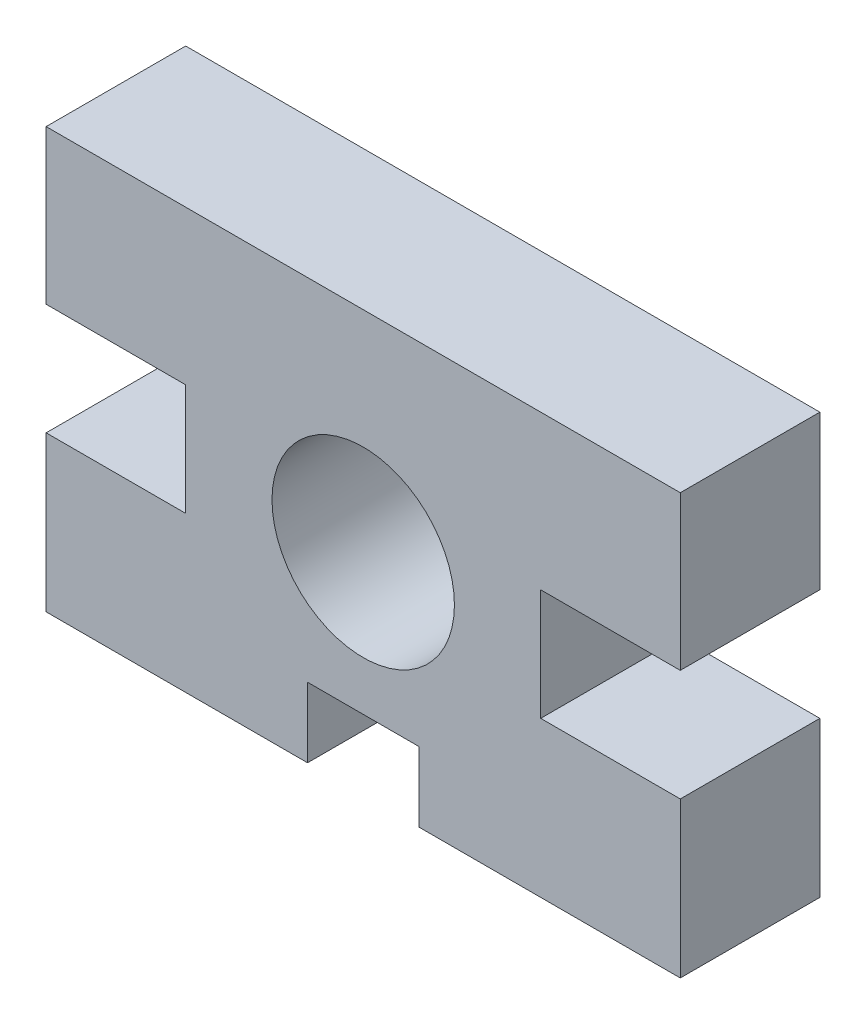
ISO-10303-21;
HEADER;
FILE_DESCRIPTION(('STEP AP214'),'2;1');
FILE_NAME('part.step','',(''),(''),'','','');
FILE_SCHEMA(('AUTOMOTIVE_DESIGN { 1 0 10303 214 1 1 1 1 }'));
ENDSEC;
DATA;
#1=APPLICATION_CONTEXT('core data for automotive mechanical design processes');
#2=APPLICATION_PROTOCOL_DEFINITION('international standard','automotive_design',2000,#1);
#3=PRODUCT_CONTEXT('',#1,'mechanical');
#4=PRODUCT('Part','Part','',(#3));
#5=PRODUCT_RELATED_PRODUCT_CATEGORY('part','',(#4));
#6=PRODUCT_DEFINITION_FORMATION('','',#4);
#7=PRODUCT_DEFINITION_CONTEXT('part definition',#1,'design');
#8=PRODUCT_DEFINITION('design','',#6,#7);
#9=PRODUCT_DEFINITION_SHAPE('','',#8);
#10=(LENGTH_UNIT() NAMED_UNIT(*) SI_UNIT(.MILLI.,.METRE.));
#11=(NAMED_UNIT(*) PLANE_ANGLE_UNIT() SI_UNIT($,.RADIAN.));
#12=(NAMED_UNIT(*) SI_UNIT($,.STERADIAN.) SOLID_ANGLE_UNIT());
#13=UNCERTAINTY_MEASURE_WITH_UNIT(LENGTH_MEASURE(1.E-05),#10,'distance_accuracy_value','');
#14=(GEOMETRIC_REPRESENTATION_CONTEXT(3) GLOBAL_UNCERTAINTY_ASSIGNED_CONTEXT((#13)) GLOBAL_UNIT_ASSIGNED_CONTEXT((#10,
#11,#12)) REPRESENTATION_CONTEXT('',''));
#15=CARTESIAN_POINT('',(0.,0.,0.));
#16=DIRECTION('',(0.,0.,1.));
#17=DIRECTION('',(1.,0.,0.));
#18=AXIS2_PLACEMENT_3D('',#15,#16,#17);
#19=CARTESIAN_POINT('',(0.,0.,6.35));
#20=DIRECTION('',(0.,0.,1.));
#21=DIRECTION('',(1.,0.,0.));
#22=AXIS2_PLACEMENT_3D('',#19,#20,#21);
#23=PLANE('',#22);
#24=DIRECTION('',(1.,0.,0.));
#25=VECTOR('',#24,1.);
#26=CARTESIAN_POINT('',(2.53250000000001,-9.56,6.35));
#27=LINE('',#26,#25);
#28=CARTESIAN_POINT('',(2.53250000000001,-9.56,6.35));
#29=VERTEX_POINT('',#28);
#30=CARTESIAN_POINT('',(14.425,-9.56,6.35));
#31=VERTEX_POINT('',#30);
#32=EDGE_CURVE('E240',#29,#31,#27,.T.);
#33=ORIENTED_EDGE('',*,*,#32,.T.);
#34=DIRECTION('',(0.,1.,0.));
#35=VECTOR('',#34,1.);
#36=CARTESIAN_POINT('',(14.425,-9.56,6.35));
#37=LINE('',#36,#35);
#38=CARTESIAN_POINT('',(14.425,-2.50514793188962,6.35));
#39=VERTEX_POINT('',#38);
#40=EDGE_CURVE('E127',#31,#39,#37,.T.);
#41=ORIENTED_EDGE('',*,*,#40,.T.);
#42=DIRECTION('',(-1.,0.,0.));
#43=VECTOR('',#42,1.);
#44=CARTESIAN_POINT('',(14.425,-2.50514793188962,6.35));
#45=LINE('',#44,#43);
#46=CARTESIAN_POINT('',(8.075,-2.50514793188962,6.35));
#47=VERTEX_POINT('',#46);
#48=EDGE_CURVE('E293',#39,#47,#45,.T.);
#49=ORIENTED_EDGE('',*,*,#48,.T.);
#50=DIRECTION('',(0.,1.,0.));
#51=VECTOR('',#50,1.);
#52=CARTESIAN_POINT('',(8.075,-2.50514793188962,6.35));
#53=LINE('',#52,#51);
#54=CARTESIAN_POINT('',(8.075,2.56000000000001,6.35));
#55=VERTEX_POINT('',#54);
#56=EDGE_CURVE('E313',#47,#55,#53,.T.);
#57=ORIENTED_EDGE('',*,*,#56,.T.);
#58=DIRECTION('',(1.,0.,0.));
#59=VECTOR('',#58,1.);
#60=CARTESIAN_POINT('',(8.075,2.56000000000001,6.35));
#61=LINE('',#60,#59);
#62=CARTESIAN_POINT('',(14.425,2.56,6.35));
#63=VERTEX_POINT('',#62);
#64=EDGE_CURVE('E309',#55,#63,#61,.T.);
#65=ORIENTED_EDGE('',*,*,#64,.T.);
#66=DIRECTION('',(0.,1.,0.));
#67=VECTOR('',#66,1.);
#68=CARTESIAN_POINT('',(14.425,9.56000000000001,6.35));
#69=LINE('',#68,#67);
#70=CARTESIAN_POINT('',(14.425,9.56000000000001,6.35));
#71=VERTEX_POINT('',#70);
#72=EDGE_CURVE('E312',#63,#71,#69,.T.);
#73=ORIENTED_EDGE('',*,*,#72,.T.);
#74=DIRECTION('',(-1.,0.,0.));
#75=VECTOR('',#74,1.);
#76=CARTESIAN_POINT('',(-14.425,9.56,6.35));
#77=LINE('',#76,#75);
#78=CARTESIAN_POINT('',(-14.425,9.56,6.35));
#79=VERTEX_POINT('',#78);
#80=EDGE_CURVE('E317',#71,#79,#77,.T.);
#81=ORIENTED_EDGE('',*,*,#80,.T.);
#82=DIRECTION('',(0.,-1.,0.));
#83=VECTOR('',#82,1.);
#84=CARTESIAN_POINT('',(-14.425,9.56,6.35));
#85=LINE('',#84,#83);
#86=CARTESIAN_POINT('',(-14.425,2.56,6.35));
#87=VERTEX_POINT('',#86);
#88=EDGE_CURVE('E324',#79,#87,#85,.T.);
#89=ORIENTED_EDGE('',*,*,#88,.T.);
#90=DIRECTION('',(1.,0.,0.));
#91=VECTOR('',#90,1.);
#92=CARTESIAN_POINT('',(-8.075,2.56000000000001,6.35));
#93=LINE('',#92,#91);
#94=CARTESIAN_POINT('',(-8.075,2.56000000000001,6.35));
#95=VERTEX_POINT('',#94);
#96=EDGE_CURVE('E327',#87,#95,#93,.T.);
#97=ORIENTED_EDGE('',*,*,#96,.T.);
#98=DIRECTION('',(0.,-1.,0.));
#99=VECTOR('',#98,1.);
#100=CARTESIAN_POINT('',(-8.075,-2.50514793188962,6.35));
#101=LINE('',#100,#99);
#102=CARTESIAN_POINT('',(-8.075,-2.50514793188962,6.35));
#103=VERTEX_POINT('',#102);
#104=EDGE_CURVE('E330',#95,#103,#101,.T.);
#105=ORIENTED_EDGE('',*,*,#104,.T.);
#106=DIRECTION('',(-1.,0.,0.));
#107=VECTOR('',#106,1.);
#108=CARTESIAN_POINT('',(-14.425,-2.50514793188962,6.35));
#109=LINE('',#108,#107);
#110=CARTESIAN_POINT('',(-14.425,-2.50514793188962,6.35));
#111=VERTEX_POINT('',#110);
#112=EDGE_CURVE('E333',#103,#111,#109,.T.);
#113=ORIENTED_EDGE('',*,*,#112,.T.);
#114=DIRECTION('',(0.,-1.,0.));
#115=VECTOR('',#114,1.);
#116=CARTESIAN_POINT('',(-14.425,-9.56,6.35));
#117=LINE('',#116,#115);
#118=CARTESIAN_POINT('',(-14.425,-9.56,6.35));
#119=VERTEX_POINT('',#118);
#120=EDGE_CURVE('E336',#111,#119,#117,.T.);
#121=ORIENTED_EDGE('',*,*,#120,.T.);
#122=DIRECTION('',(1.,0.,0.));
#123=VECTOR('',#122,1.);
#124=CARTESIAN_POINT('',(-14.425,-9.56,6.35));
#125=LINE('',#124,#123);
#126=CARTESIAN_POINT('',(-2.53249999999999,-9.56,6.35));
#127=VERTEX_POINT('',#126);
#128=EDGE_CURVE('E170',#119,#127,#125,.T.);
#129=ORIENTED_EDGE('',*,*,#128,.T.);
#130=DIRECTION('',(0.,1.,0.));
#131=VECTOR('',#130,1.);
#132=CARTESIAN_POINT('',(-2.53249999999999,-9.56,6.35));
#133=LINE('',#132,#131);
#134=CARTESIAN_POINT('',(-2.53249999999999,-6.38499999999999,6.35));
#135=VERTEX_POINT('',#134);
#136=EDGE_CURVE('E164',#127,#135,#133,.T.);
#137=ORIENTED_EDGE('',*,*,#136,.T.);
#138=DIRECTION('',(1.,0.,0.));
#139=VECTOR('',#138,1.);
#140=CARTESIAN_POINT('',(0.,-6.38499999999999,6.35));
#141=LINE('',#140,#139);
#142=CARTESIAN_POINT('',(2.53250000000001,-6.38499999999999,6.35));
#143=VERTEX_POINT('',#142);
#144=EDGE_CURVE('E168',#135,#143,#141,.T.);
#145=ORIENTED_EDGE('',*,*,#144,.T.);
#146=DIRECTION('',(0.,-1.,0.));
#147=VECTOR('',#146,1.);
#148=CARTESIAN_POINT('',(2.53250000000001,-6.38499999999999,6.35));
#149=LINE('',#148,#147);
#150=EDGE_CURVE('E61',#143,#29,#149,.T.);
#151=ORIENTED_EDGE('',*,*,#150,.T.);
#152=EDGE_LOOP('',(#33,#41,#49,#57,#65,#73,#81,#89,#97,#105,#113,#121,#129,#137,#145,#151));
#153=FACE_BOUND('',#152,.T.);
#154=CARTESIAN_POINT('',(0.,0.,6.35));
#155=DIRECTION('',(0.,0.,1.));
#156=DIRECTION('',(1.,0.,0.));
#157=AXIS2_PLACEMENT_3D('',#154,#155,#156);
#158=CIRCLE('',#157,4.15);
#159=CARTESIAN_POINT('',(4.15,0.,6.35));
#160=VERTEX_POINT('',#159);
#161=EDGE_CURVE('E198',#160,#160,#158,.T.);
#162=ORIENTED_EDGE('',*,*,#161,.F.);
#163=EDGE_LOOP('',(#162));
#164=FACE_BOUND('',#163,.T.);
#165=ADVANCED_FACE('F43',(#153,#164),#23,.T.);
#166=CARTESIAN_POINT('',(0.,0.,0.));
#167=DIRECTION('',(0.,0.,1.));
#168=DIRECTION('',(1.,0.,0.));
#169=AXIS2_PLACEMENT_3D('',#166,#167,#168);
#170=PLANE('',#169);
#171=DIRECTION('',(1.,0.,0.));
#172=VECTOR('',#171,1.);
#173=CARTESIAN_POINT('',(2.53250000000001,-9.56,0.));
#174=LINE('',#173,#172);
#175=CARTESIAN_POINT('',(2.53250000000001,-9.56,0.));
#176=VERTEX_POINT('',#175);
#177=CARTESIAN_POINT('',(14.425,-9.56,0.));
#178=VERTEX_POINT('',#177);
#179=EDGE_CURVE('E193',#176,#178,#174,.T.);
#180=ORIENTED_EDGE('',*,*,#179,.F.);
#181=DIRECTION('',(0.,-1.,0.));
#182=VECTOR('',#181,1.);
#183=CARTESIAN_POINT('',(2.53250000000001,-6.38499999999999,0.));
#184=LINE('',#183,#182);
#185=CARTESIAN_POINT('',(2.53250000000001,-6.38499999999999,0.));
#186=VERTEX_POINT('',#185);
#187=EDGE_CURVE('E119',#186,#176,#184,.T.);
#188=ORIENTED_EDGE('',*,*,#187,.F.);
#189=DIRECTION('',(1.,0.,0.));
#190=VECTOR('',#189,1.);
#191=CARTESIAN_POINT('',(0.,-6.38499999999999,0.));
#192=LINE('',#191,#190);
#193=CARTESIAN_POINT('',(-2.53249999999999,-6.38499999999999,0.));
#194=VERTEX_POINT('',#193);
#195=EDGE_CURVE('E113',#194,#186,#192,.T.);
#196=ORIENTED_EDGE('',*,*,#195,.F.);
#197=DIRECTION('',(0.,1.,0.));
#198=VECTOR('',#197,1.);
#199=CARTESIAN_POINT('',(-2.53249999999999,-9.56,0.));
#200=LINE('',#199,#198);
#201=CARTESIAN_POINT('',(-2.53249999999999,-9.56,0.));
#202=VERTEX_POINT('',#201);
#203=EDGE_CURVE('E180',#202,#194,#200,.T.);
#204=ORIENTED_EDGE('',*,*,#203,.F.);
#205=DIRECTION('',(1.,0.,0.));
#206=VECTOR('',#205,1.);
#207=CARTESIAN_POINT('',(-14.425,-9.56,0.));
#208=LINE('',#207,#206);
#209=CARTESIAN_POINT('',(-14.425,-9.56,0.));
#210=VERTEX_POINT('',#209);
#211=EDGE_CURVE('E231',#210,#202,#208,.T.);
#212=ORIENTED_EDGE('',*,*,#211,.F.);
#213=DIRECTION('',(0.,-1.,0.));
#214=VECTOR('',#213,1.);
#215=CARTESIAN_POINT('',(-14.425,-9.56,0.));
#216=LINE('',#215,#214);
#217=CARTESIAN_POINT('',(-14.425,-2.50514793188962,0.));
#218=VERTEX_POINT('',#217);
#219=EDGE_CURVE('E228',#218,#210,#216,.T.);
#220=ORIENTED_EDGE('',*,*,#219,.F.);
#221=DIRECTION('',(-1.,0.,0.));
#222=VECTOR('',#221,1.);
#223=CARTESIAN_POINT('',(-14.425,-2.50514793188962,0.));
#224=LINE('',#223,#222);
#225=CARTESIAN_POINT('',(-8.075,-2.50514793188962,0.));
#226=VERTEX_POINT('',#225);
#227=EDGE_CURVE('E225',#226,#218,#224,.T.);
#228=ORIENTED_EDGE('',*,*,#227,.F.);
#229=DIRECTION('',(0.,-1.,0.));
#230=VECTOR('',#229,1.);
#231=CARTESIAN_POINT('',(-8.075,-2.50514793188962,0.));
#232=LINE('',#231,#230);
#233=CARTESIAN_POINT('',(-8.075,2.56000000000001,0.));
#234=VERTEX_POINT('',#233);
#235=EDGE_CURVE('E222',#234,#226,#232,.T.);
#236=ORIENTED_EDGE('',*,*,#235,.F.);
#237=DIRECTION('',(1.,0.,0.));
#238=VECTOR('',#237,1.);
#239=CARTESIAN_POINT('',(-8.075,2.56000000000001,0.));
#240=LINE('',#239,#238);
#241=CARTESIAN_POINT('',(-14.425,2.56,0.));
#242=VERTEX_POINT('',#241);
#243=EDGE_CURVE('E219',#242,#234,#240,.T.);
#244=ORIENTED_EDGE('',*,*,#243,.F.);
#245=DIRECTION('',(0.,-1.,0.));
#246=VECTOR('',#245,1.);
#247=CARTESIAN_POINT('',(-14.425,9.56,0.));
#248=LINE('',#247,#246);
#249=CARTESIAN_POINT('',(-14.425,9.56,0.));
#250=VERTEX_POINT('',#249);
#251=EDGE_CURVE('E216',#250,#242,#248,.T.);
#252=ORIENTED_EDGE('',*,*,#251,.F.);
#253=DIRECTION('',(-1.,0.,0.));
#254=VECTOR('',#253,1.);
#255=CARTESIAN_POINT('',(-14.425,9.56,0.));
#256=LINE('',#255,#254);
#257=CARTESIAN_POINT('',(14.425,9.56000000000001,0.));
#258=VERTEX_POINT('',#257);
#259=EDGE_CURVE('E213',#258,#250,#256,.T.);
#260=ORIENTED_EDGE('',*,*,#259,.F.);
#261=DIRECTION('',(0.,1.,0.));
#262=VECTOR('',#261,1.);
#263=CARTESIAN_POINT('',(14.425,9.56000000000001,0.));
#264=LINE('',#263,#262);
#265=CARTESIAN_POINT('',(14.425,2.56,0.));
#266=VERTEX_POINT('',#265);
#267=EDGE_CURVE('E210',#266,#258,#264,.T.);
#268=ORIENTED_EDGE('',*,*,#267,.F.);
#269=DIRECTION('',(1.,0.,0.));
#270=VECTOR('',#269,1.);
#271=CARTESIAN_POINT('',(8.075,2.56000000000001,0.));
#272=LINE('',#271,#270);
#273=CARTESIAN_POINT('',(8.075,2.56000000000001,0.));
#274=VERTEX_POINT('',#273);
#275=EDGE_CURVE('E207',#274,#266,#272,.T.);
#276=ORIENTED_EDGE('',*,*,#275,.F.);
#277=DIRECTION('',(0.,1.,0.));
#278=VECTOR('',#277,1.);
#279=CARTESIAN_POINT('',(8.075,-2.50514793188962,0.));
#280=LINE('',#279,#278);
#281=CARTESIAN_POINT('',(8.075,-2.50514793188962,0.));
#282=VERTEX_POINT('',#281);
#283=EDGE_CURVE('E204',#282,#274,#280,.T.);
#284=ORIENTED_EDGE('',*,*,#283,.F.);
#285=DIRECTION('',(-1.,0.,0.));
#286=VECTOR('',#285,1.);
#287=CARTESIAN_POINT('',(14.425,-2.50514793188962,0.));
#288=LINE('',#287,#286);
#289=CARTESIAN_POINT('',(14.425,-2.50514793188962,0.));
#290=VERTEX_POINT('',#289);
#291=EDGE_CURVE('E201',#290,#282,#288,.T.);
#292=ORIENTED_EDGE('',*,*,#291,.F.);
#293=DIRECTION('',(0.,1.,0.));
#294=VECTOR('',#293,1.);
#295=CARTESIAN_POINT('',(14.425,-9.56,0.));
#296=LINE('',#295,#294);
#297=EDGE_CURVE('E197',#178,#290,#296,.T.);
#298=ORIENTED_EDGE('',*,*,#297,.F.);
#299=EDGE_LOOP('',(#180,#188,#196,#204,#212,#220,#228,#236,#244,#252,#260,#268,#276,#284,#292,#298));
#300=FACE_BOUND('',#299,.T.);
#301=CARTESIAN_POINT('',(0.,0.,0.));
#302=DIRECTION('',(0.,0.,1.));
#303=DIRECTION('',(1.,0.,0.));
#304=AXIS2_PLACEMENT_3D('',#301,#302,#303);
#305=CIRCLE('',#304,4.15);
#306=CARTESIAN_POINT('',(4.15,0.,0.));
#307=VERTEX_POINT('',#306);
#308=EDGE_CURVE('E578',#307,#307,#305,.T.);
#309=ORIENTED_EDGE('',*,*,#308,.T.);
#310=EDGE_LOOP('',(#309));
#311=FACE_BOUND('',#310,.T.);
#312=ADVANCED_FACE('F297',(#300,#311),#170,.F.);
#313=CARTESIAN_POINT('',(2.53250000000001,-9.56,6.35));
#314=DIRECTION('',(0.,1.,0.));
#315=DIRECTION('',(0.,0.,1.));
#316=AXIS2_PLACEMENT_3D('',#313,#314,#315);
#317=PLANE('',#316);
#318=ORIENTED_EDGE('',*,*,#179,.T.);
#319=DIRECTION('',(0.,0.,-1.));
#320=VECTOR('',#319,1.);
#321=CARTESIAN_POINT('',(14.425,-9.56,6.35));
#322=LINE('',#321,#320);
#323=EDGE_CURVE('E11',#31,#178,#322,.T.);
#324=ORIENTED_EDGE('',*,*,#323,.F.);
#325=ORIENTED_EDGE('',*,*,#32,.F.);
#326=DIRECTION('',(0.,0.,-1.));
#327=VECTOR('',#326,1.);
#328=CARTESIAN_POINT('',(2.53250000000001,-9.56,6.35));
#329=LINE('',#328,#327);
#330=EDGE_CURVE('E189',#29,#176,#329,.T.);
#331=ORIENTED_EDGE('',*,*,#330,.T.);
#332=EDGE_LOOP('',(#318,#324,#325,#331));
#333=FACE_BOUND('',#332,.T.);
#334=ADVANCED_FACE('F45',(#333),#317,.F.);
#335=CARTESIAN_POINT('',(14.425,-9.56,6.35));
#336=DIRECTION('',(-1.,0.,0.));
#337=DIRECTION('',(0.,-1.,0.));
#338=AXIS2_PLACEMENT_3D('',#335,#336,#337);
#339=PLANE('',#338);
#340=ORIENTED_EDGE('',*,*,#297,.T.);
#341=DIRECTION('',(0.,0.,-1.));
#342=VECTOR('',#341,1.);
#343=CARTESIAN_POINT('',(14.425,-2.50514793188962,6.35));
#344=LINE('',#343,#342);
#345=EDGE_CURVE('E53',#39,#290,#344,.T.);
#346=ORIENTED_EDGE('',*,*,#345,.F.);
#347=ORIENTED_EDGE('',*,*,#40,.F.);
#348=ORIENTED_EDGE('',*,*,#323,.T.);
#349=EDGE_LOOP('',(#340,#346,#347,#348));
#350=FACE_BOUND('',#349,.T.);
#351=ADVANCED_FACE('F372',(#350),#339,.F.);
#352=CARTESIAN_POINT('',(14.425,-2.50514793188962,6.35));
#353=DIRECTION('',(0.,-1.,0.));
#354=DIRECTION('',(1.,0.,0.));
#355=AXIS2_PLACEMENT_3D('',#352,#353,#354);
#356=PLANE('',#355);
#357=ORIENTED_EDGE('',*,*,#291,.T.);
#358=DIRECTION('',(0.,0.,-1.));
#359=VECTOR('',#358,1.);
#360=CARTESIAN_POINT('',(8.075,-2.50514793188962,6.35));
#361=LINE('',#360,#359);
#362=EDGE_CURVE('E283',#47,#282,#361,.T.);
#363=ORIENTED_EDGE('',*,*,#362,.F.);
#364=ORIENTED_EDGE('',*,*,#48,.F.);
#365=ORIENTED_EDGE('',*,*,#345,.T.);
#366=EDGE_LOOP('',(#357,#363,#364,#365));
#367=FACE_BOUND('',#366,.T.);
#368=ADVANCED_FACE('F291',(#367),#356,.F.);
#369=CARTESIAN_POINT('',(8.075,-2.50514793188962,6.35));
#370=DIRECTION('',(-1.,0.,0.));
#371=DIRECTION('',(0.,0.,1.));
#372=AXIS2_PLACEMENT_3D('',#369,#370,#371);
#373=PLANE('',#372);
#374=ORIENTED_EDGE('',*,*,#283,.T.);
#375=DIRECTION('',(0.,0.,-1.));
#376=VECTOR('',#375,1.);
#377=CARTESIAN_POINT('',(8.075,2.56000000000001,6.35));
#378=LINE('',#377,#376);
#379=EDGE_CURVE('E279',#55,#274,#378,.T.);
#380=ORIENTED_EDGE('',*,*,#379,.F.);
#381=ORIENTED_EDGE('',*,*,#56,.F.);
#382=ORIENTED_EDGE('',*,*,#362,.T.);
#383=EDGE_LOOP('',(#374,#380,#381,#382));
#384=FACE_BOUND('',#383,.T.);
#385=ADVANCED_FACE('F303',(#384),#373,.F.);
#386=CARTESIAN_POINT('',(8.075,2.56000000000001,6.35));
#387=DIRECTION('',(0.,1.,0.));
#388=DIRECTION('',(-1.,0.,0.));
#389=AXIS2_PLACEMENT_3D('',#386,#387,#388);
#390=PLANE('',#389);
#391=ORIENTED_EDGE('',*,*,#275,.T.);
#392=DIRECTION('',(0.,0.,-1.));
#393=VECTOR('',#392,1.);
#394=CARTESIAN_POINT('',(14.425,2.56,6.35));
#395=LINE('',#394,#393);
#396=EDGE_CURVE('E275',#63,#266,#395,.T.);
#397=ORIENTED_EDGE('',*,*,#396,.F.);
#398=ORIENTED_EDGE('',*,*,#64,.F.);
#399=ORIENTED_EDGE('',*,*,#379,.T.);
#400=EDGE_LOOP('',(#391,#397,#398,#399));
#401=FACE_BOUND('',#400,.T.);
#402=ADVANCED_FACE('F307',(#401),#390,.F.);
#403=CARTESIAN_POINT('',(14.425,9.56000000000001,6.35));
#404=DIRECTION('',(-1.,0.,0.));
#405=DIRECTION('',(0.,-1.,0.));
#406=AXIS2_PLACEMENT_3D('',#403,#404,#405);
#407=PLANE('',#406);
#408=ORIENTED_EDGE('',*,*,#267,.T.);
#409=DIRECTION('',(0.,0.,-1.));
#410=VECTOR('',#409,1.);
#411=CARTESIAN_POINT('',(14.425,9.56000000000001,6.35));
#412=LINE('',#411,#410);
#413=EDGE_CURVE('E271',#71,#258,#412,.T.);
#414=ORIENTED_EDGE('',*,*,#413,.F.);
#415=ORIENTED_EDGE('',*,*,#72,.F.);
#416=ORIENTED_EDGE('',*,*,#396,.T.);
#417=EDGE_LOOP('',(#408,#414,#415,#416));
#418=FACE_BOUND('',#417,.T.);
#419=ADVANCED_FACE('F385',(#418),#407,.F.);
#420=CARTESIAN_POINT('',(-14.425,9.56,6.35));
#421=DIRECTION('',(0.,-1.,0.));
#422=DIRECTION('',(1.,0.,0.));
#423=AXIS2_PLACEMENT_3D('',#420,#421,#422);
#424=PLANE('',#423);
#425=ORIENTED_EDGE('',*,*,#259,.T.);
#426=DIRECTION('',(0.,0.,-1.));
#427=VECTOR('',#426,1.);
#428=CARTESIAN_POINT('',(-14.425,9.56,6.35));
#429=LINE('',#428,#427);
#430=EDGE_CURVE('E267',#79,#250,#429,.T.);
#431=ORIENTED_EDGE('',*,*,#430,.F.);
#432=ORIENTED_EDGE('',*,*,#80,.F.);
#433=ORIENTED_EDGE('',*,*,#413,.T.);
#434=EDGE_LOOP('',(#425,#431,#432,#433));
#435=FACE_BOUND('',#434,.T.);
#436=ADVANCED_FACE('F388',(#435),#424,.F.);
#437=CARTESIAN_POINT('',(-14.425,9.56,6.35));
#438=DIRECTION('',(1.,0.,0.));
#439=DIRECTION('',(0.,1.,0.));
#440=AXIS2_PLACEMENT_3D('',#437,#438,#439);
#441=PLANE('',#440);
#442=ORIENTED_EDGE('',*,*,#251,.T.);
#443=DIRECTION('',(0.,0.,-1.));
#444=VECTOR('',#443,1.);
#445=CARTESIAN_POINT('',(-14.425,2.56,6.35));
#446=LINE('',#445,#444);
#447=EDGE_CURVE('E263',#87,#242,#446,.T.);
#448=ORIENTED_EDGE('',*,*,#447,.F.);
#449=ORIENTED_EDGE('',*,*,#88,.F.);
#450=ORIENTED_EDGE('',*,*,#430,.T.);
#451=EDGE_LOOP('',(#442,#448,#449,#450));
#452=FACE_BOUND('',#451,.T.);
#453=ADVANCED_FACE('F392',(#452),#441,.F.);
#454=CARTESIAN_POINT('',(-8.075,2.56000000000001,6.35));
#455=DIRECTION('',(0.,1.,0.));
#456=DIRECTION('',(-1.,0.,0.));
#457=AXIS2_PLACEMENT_3D('',#454,#455,#456);
#458=PLANE('',#457);
#459=ORIENTED_EDGE('',*,*,#243,.T.);
#460=DIRECTION('',(0.,0.,-1.));
#461=VECTOR('',#460,1.);
#462=CARTESIAN_POINT('',(-8.075,2.56000000000001,6.35));
#463=LINE('',#462,#461);
#464=EDGE_CURVE('E259',#95,#234,#463,.T.);
#465=ORIENTED_EDGE('',*,*,#464,.F.);
#466=ORIENTED_EDGE('',*,*,#96,.F.);
#467=ORIENTED_EDGE('',*,*,#447,.T.);
#468=EDGE_LOOP('',(#459,#465,#466,#467));
#469=FACE_BOUND('',#468,.T.);
#470=ADVANCED_FACE('F396',(#469),#458,.F.);
#471=CARTESIAN_POINT('',(-8.075,-2.50514793188962,6.35));
#472=DIRECTION('',(1.,0.,0.));
#473=DIRECTION('',(0.,1.,0.));
#474=AXIS2_PLACEMENT_3D('',#471,#472,#473);
#475=PLANE('',#474);
#476=ORIENTED_EDGE('',*,*,#235,.T.);
#477=DIRECTION('',(0.,0.,-1.));
#478=VECTOR('',#477,1.);
#479=CARTESIAN_POINT('',(-8.075,-2.50514793188962,6.35));
#480=LINE('',#479,#478);
#481=EDGE_CURVE('E255',#103,#226,#480,.T.);
#482=ORIENTED_EDGE('',*,*,#481,.F.);
#483=ORIENTED_EDGE('',*,*,#104,.F.);
#484=ORIENTED_EDGE('',*,*,#464,.T.);
#485=EDGE_LOOP('',(#476,#482,#483,#484));
#486=FACE_BOUND('',#485,.T.);
#487=ADVANCED_FACE('F400',(#486),#475,.F.);
#488=CARTESIAN_POINT('',(-14.425,-2.50514793188962,6.35));
#489=DIRECTION('',(0.,-1.,0.));
#490=DIRECTION('',(0.,0.,-1.));
#491=AXIS2_PLACEMENT_3D('',#488,#489,#490);
#492=PLANE('',#491);
#493=ORIENTED_EDGE('',*,*,#227,.T.);
#494=DIRECTION('',(0.,0.,-1.));
#495=VECTOR('',#494,1.);
#496=CARTESIAN_POINT('',(-14.425,-2.50514793188962,6.35));
#497=LINE('',#496,#495);
#498=EDGE_CURVE('E251',#111,#218,#497,.T.);
#499=ORIENTED_EDGE('',*,*,#498,.F.);
#500=ORIENTED_EDGE('',*,*,#112,.F.);
#501=ORIENTED_EDGE('',*,*,#481,.T.);
#502=EDGE_LOOP('',(#493,#499,#500,#501));
#503=FACE_BOUND('',#502,.T.);
#504=ADVANCED_FACE('F404',(#503),#492,.F.);
#505=CARTESIAN_POINT('',(-14.425,-9.56,6.35));
#506=DIRECTION('',(1.,0.,0.));
#507=DIRECTION('',(0.,1.,0.));
#508=AXIS2_PLACEMENT_3D('',#505,#506,#507);
#509=PLANE('',#508);
#510=ORIENTED_EDGE('',*,*,#219,.T.);
#511=DIRECTION('',(0.,0.,-1.));
#512=VECTOR('',#511,1.);
#513=CARTESIAN_POINT('',(-14.425,-9.56,6.35));
#514=LINE('',#513,#512);
#515=EDGE_CURVE('E247',#119,#210,#514,.T.);
#516=ORIENTED_EDGE('',*,*,#515,.F.);
#517=ORIENTED_EDGE('',*,*,#120,.F.);
#518=ORIENTED_EDGE('',*,*,#498,.T.);
#519=EDGE_LOOP('',(#510,#516,#517,#518));
#520=FACE_BOUND('',#519,.T.);
#521=ADVANCED_FACE('F344',(#520),#509,.F.);
#522=CARTESIAN_POINT('',(-14.425,-9.56,6.35));
#523=DIRECTION('',(0.,1.,0.));
#524=DIRECTION('',(0.,0.,1.));
#525=AXIS2_PLACEMENT_3D('',#522,#523,#524);
#526=PLANE('',#525);
#527=ORIENTED_EDGE('',*,*,#211,.T.);
#528=DIRECTION('',(0.,0.,-1.));
#529=VECTOR('',#528,1.);
#530=CARTESIAN_POINT('',(-2.53249999999999,-9.56,6.35));
#531=LINE('',#530,#529);
#532=EDGE_CURVE('E182',#127,#202,#531,.T.);
#533=ORIENTED_EDGE('',*,*,#532,.F.);
#534=ORIENTED_EDGE('',*,*,#128,.F.);
#535=ORIENTED_EDGE('',*,*,#515,.T.);
#536=EDGE_LOOP('',(#527,#533,#534,#535));
#537=FACE_BOUND('',#536,.T.);
#538=ADVANCED_FACE('F348',(#537),#526,.F.);
#539=CARTESIAN_POINT('',(-2.53249999999999,-9.56,6.35));
#540=DIRECTION('',(-1.,0.,0.));
#541=DIRECTION('',(0.,-1.,0.));
#542=AXIS2_PLACEMENT_3D('',#539,#540,#541);
#543=PLANE('',#542);
#544=ORIENTED_EDGE('',*,*,#203,.T.);
#545=DIRECTION('',(0.,0.,-1.));
#546=VECTOR('',#545,1.);
#547=CARTESIAN_POINT('',(-2.53249999999999,-6.38499999999999,6.35));
#548=LINE('',#547,#546);
#549=EDGE_CURVE('E177',#135,#194,#548,.T.);
#550=ORIENTED_EDGE('',*,*,#549,.F.);
#551=ORIENTED_EDGE('',*,*,#136,.F.);
#552=ORIENTED_EDGE('',*,*,#532,.T.);
#553=EDGE_LOOP('',(#544,#550,#551,#552));
#554=FACE_BOUND('',#553,.T.);
#555=ADVANCED_FACE('F178',(#554),#543,.F.);
#556=CARTESIAN_POINT('',(0.,-6.38499999999999,6.35));
#557=DIRECTION('',(0.,1.,0.));
#558=DIRECTION('',(-1.,0.,0.));
#559=AXIS2_PLACEMENT_3D('',#556,#557,#558);
#560=PLANE('',#559);
#561=ORIENTED_EDGE('',*,*,#195,.T.);
#562=DIRECTION('',(0.,0.,-1.));
#563=VECTOR('',#562,1.);
#564=CARTESIAN_POINT('',(2.53250000000001,-6.38499999999999,6.35));
#565=LINE('',#564,#563);
#566=EDGE_CURVE('E183',#143,#186,#565,.T.);
#567=ORIENTED_EDGE('',*,*,#566,.F.);
#568=ORIENTED_EDGE('',*,*,#144,.F.);
#569=ORIENTED_EDGE('',*,*,#549,.T.);
#570=EDGE_LOOP('',(#561,#567,#568,#569));
#571=FACE_BOUND('',#570,.T.);
#572=ADVANCED_FACE('F185',(#571),#560,.F.);
#573=CARTESIAN_POINT('',(2.53250000000001,-6.38499999999999,6.35));
#574=DIRECTION('',(1.,0.,0.));
#575=DIRECTION('',(0.,1.,0.));
#576=AXIS2_PLACEMENT_3D('',#573,#574,#575);
#577=PLANE('',#576);
#578=ORIENTED_EDGE('',*,*,#187,.T.);
#579=ORIENTED_EDGE('',*,*,#330,.F.);
#580=ORIENTED_EDGE('',*,*,#150,.F.);
#581=ORIENTED_EDGE('',*,*,#566,.T.);
#582=EDGE_LOOP('',(#578,#579,#580,#581));
#583=FACE_BOUND('',#582,.T.);
#584=ADVANCED_FACE('F352',(#583),#577,.F.);
#585=CARTESIAN_POINT('',(0.,0.,6.35));
#586=DIRECTION('',(0.,0.,-1.));
#587=DIRECTION('',(-1.,0.,0.));
#588=AXIS2_PLACEMENT_3D('',#585,#586,#587);
#589=CYLINDRICAL_SURFACE('',#588,4.15);
#590=ORIENTED_EDGE('',*,*,#161,.T.);
#591=EDGE_LOOP('',(#590));
#592=FACE_BOUND('',#591,.T.);
#593=ORIENTED_EDGE('',*,*,#308,.F.);
#594=EDGE_LOOP('',(#593));
#595=FACE_BOUND('',#594,.T.);
#596=ADVANCED_FACE('F354',(#592,#595),#589,.F.);
#597=CLOSED_SHELL('',(#165,#312,#334,#351,#368,#385,#402,#419,#436,#453,#470,#487,#504,#521,
#538,#555,#572,#584,#596));
#598=MANIFOLD_SOLID_BREP('B2',#597);
#599=ADVANCED_BREP_SHAPE_REPRESENTATION('',(#18,#598),#14);
#600=SHAPE_DEFINITION_REPRESENTATION(#9,#599);
ENDSEC;
END-ISO-10303-21;
